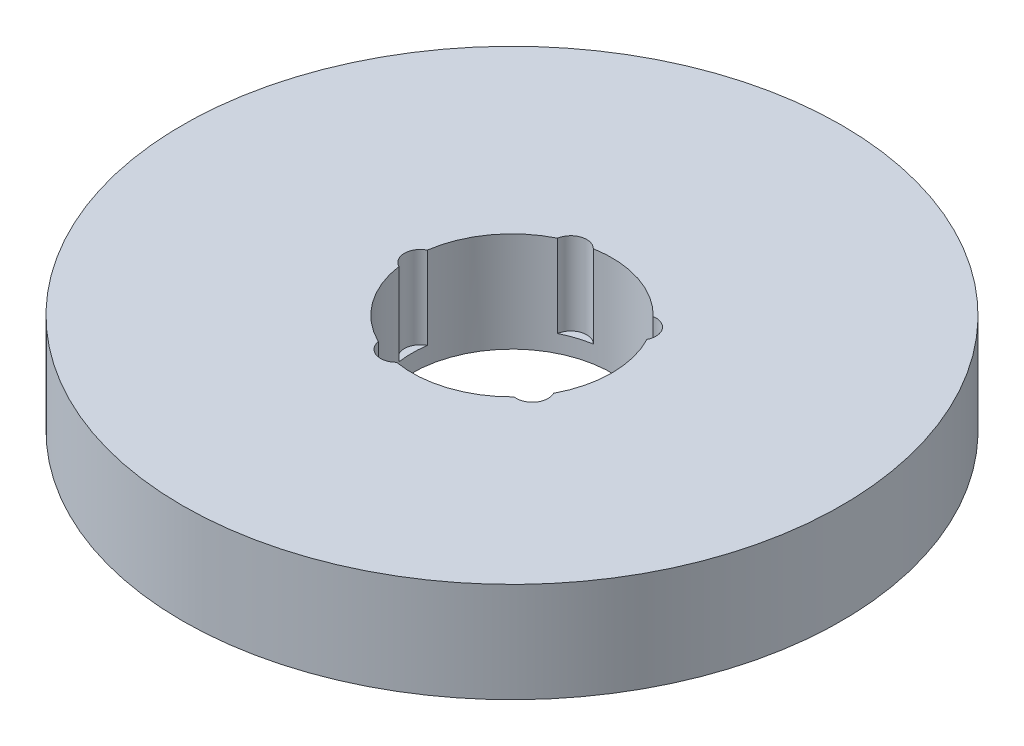
ISO-10303-21;
HEADER;
FILE_DESCRIPTION(('STEP AP214'),'2;1');
FILE_NAME('part.step','',(''),(''),'','','');
FILE_SCHEMA(('AUTOMOTIVE_DESIGN { 1 0 10303 214 1 1 1 1 }'));
ENDSEC;
DATA;
#1=APPLICATION_CONTEXT('core data for automotive mechanical design processes');
#2=APPLICATION_PROTOCOL_DEFINITION('international standard','automotive_design',2000,#1);
#3=PRODUCT_CONTEXT('',#1,'mechanical');
#4=PRODUCT('Part','Part','',(#3));
#5=PRODUCT_RELATED_PRODUCT_CATEGORY('part','',(#4));
#6=PRODUCT_DEFINITION_FORMATION('','',#4);
#7=PRODUCT_DEFINITION_CONTEXT('part definition',#1,'design');
#8=PRODUCT_DEFINITION('design','',#6,#7);
#9=PRODUCT_DEFINITION_SHAPE('','',#8);
#10=(LENGTH_UNIT() NAMED_UNIT(*) SI_UNIT(.MILLI.,.METRE.));
#11=(NAMED_UNIT(*) PLANE_ANGLE_UNIT() SI_UNIT($,.RADIAN.));
#12=(NAMED_UNIT(*) SI_UNIT($,.STERADIAN.) SOLID_ANGLE_UNIT());
#13=UNCERTAINTY_MEASURE_WITH_UNIT(LENGTH_MEASURE(1.E-05),#10,'distance_accuracy_value','');
#14=(GEOMETRIC_REPRESENTATION_CONTEXT(3) GLOBAL_UNCERTAINTY_ASSIGNED_CONTEXT((#13)) GLOBAL_UNIT_ASSIGNED_CONTEXT((#10,
#11,#12)) REPRESENTATION_CONTEXT('',''));
#15=CARTESIAN_POINT('',(0.,0.,0.));
#16=DIRECTION('',(0.,0.,1.));
#17=DIRECTION('',(1.,0.,0.));
#18=AXIS2_PLACEMENT_3D('',#15,#16,#17);
#19=CARTESIAN_POINT('',(0.,25.,0.));
#20=DIRECTION('',(0.,-1.,0.));
#21=DIRECTION('',(0.,0.,-1.));
#22=AXIS2_PLACEMENT_3D('',#19,#20,#21);
#23=CYLINDRICAL_SURFACE('',#22,82.5);
#24=CARTESIAN_POINT('',(0.,25.,0.));
#25=DIRECTION('',(0.,1.,0.));
#26=DIRECTION('',(0.,0.,1.));
#27=AXIS2_PLACEMENT_3D('',#24,#25,#26);
#28=CIRCLE('',#27,82.5);
#29=CARTESIAN_POINT('',(0.,25.,82.5));
#30=VERTEX_POINT('',#29);
#31=EDGE_CURVE('E159',#30,#30,#28,.T.);
#32=ORIENTED_EDGE('',*,*,#31,.F.);
#33=EDGE_LOOP('',(#32));
#34=FACE_BOUND('',#33,.T.);
#35=CARTESIAN_POINT('',(0.,0.,0.));
#36=DIRECTION('',(0.,1.,0.));
#37=DIRECTION('',(0.,0.,1.));
#38=AXIS2_PLACEMENT_3D('',#35,#36,#37);
#39=CIRCLE('',#38,82.5);
#40=CARTESIAN_POINT('',(0.,0.,82.5));
#41=VERTEX_POINT('',#40);
#42=EDGE_CURVE('E152',#41,#41,#39,.T.);
#43=ORIENTED_EDGE('',*,*,#42,.T.);
#44=EDGE_LOOP('',(#43));
#45=FACE_BOUND('',#44,.T.);
#46=ADVANCED_FACE('F39',(#34,#45),#23,.T.);
#47=CARTESIAN_POINT('',(0.,25.,0.));
#48=DIRECTION('',(0.,1.,0.));
#49=DIRECTION('',(0.,0.,1.));
#50=AXIS2_PLACEMENT_3D('',#47,#48,#49);
#51=PLANE('',#50);
#52=CARTESIAN_POINT('',(-7.0887619418406,25.,21.8169659273575));
#53=DIRECTION('',(0.,1.,0.));
#54=DIRECTION('',(0.951056516295155,0.,0.309016994374945));
#55=AXIS2_PLACEMENT_3D('',#52,#53,#54);
#56=CIRCLE('',#55,3.98516657410664);
#57=CARTESIAN_POINT('',(-11.0253166271495,25.,22.4375219948884));
#58=VERTEX_POINT('',#57);
#59=CARTESIAN_POINT('',(-4.26877600685464,25.,24.6328551208199));
#60=VERTEX_POINT('',#59);
#61=EDGE_CURVE('E192',#58,#60,#56,.T.);
#62=ORIENTED_EDGE('',*,*,#61,.F.);
#63=CARTESIAN_POINT('',(0.,25.,0.));
#64=DIRECTION('',(0.,1.,0.));
#65=DIRECTION('',(0.,0.,1.));
#66=AXIS2_PLACEMENT_3D('',#63,#64,#65);
#67=CIRCLE('',#66,25.);
#68=CARTESIAN_POINT('',(-24.7463617089083,25.,3.55212361438571));
#69=VERTEX_POINT('',#68);
#70=EDGE_CURVE('E147',#69,#58,#67,.T.);
#71=ORIENTED_EDGE('',*,*,#70,.F.);
#72=CARTESIAN_POINT('',(-22.9397155201098,25.,0.));
#73=DIRECTION('',(0.,1.,0.));
#74=DIRECTION('',(0.,0.,1.));
#75=AXIS2_PLACEMENT_3D('',#72,#73,#74);
#76=CIRCLE('',#75,3.98516657410664);
#77=CARTESIAN_POINT('',(-24.7463617089083,25.,-3.55212361438571));
#78=VERTEX_POINT('',#77);
#79=EDGE_CURVE('E154',#78,#69,#76,.T.);
#80=ORIENTED_EDGE('',*,*,#79,.F.);
#81=CARTESIAN_POINT('',(-11.0253166271498,25.,-22.4375219948883));
#82=VERTEX_POINT('',#81);
#83=EDGE_CURVE('E136',#82,#78,#67,.T.);
#84=ORIENTED_EDGE('',*,*,#83,.F.);
#85=CARTESIAN_POINT('',(-7.0887619418409,25.,-21.8169659273574));
#86=DIRECTION('',(0.,1.,0.));
#87=DIRECTION('',(-0.95105651629515,0.,0.309016994374958));
#88=AXIS2_PLACEMENT_3D('',#85,#86,#87);
#89=CIRCLE('',#88,3.98516657410664);
#90=CARTESIAN_POINT('',(-4.26877600685499,25.,-24.6328551208198));
#91=VERTEX_POINT('',#90);
#92=EDGE_CURVE('E117',#91,#82,#89,.T.);
#93=ORIENTED_EDGE('',*,*,#92,.F.);
#94=CARTESIAN_POINT('',(17.9323412966004,25.,-17.4192748305502));
#95=VERTEX_POINT('',#94);
#96=EDGE_CURVE('E133',#95,#91,#67,.T.);
#97=ORIENTED_EDGE('',*,*,#96,.F.);
#98=CARTESIAN_POINT('',(18.5586197018954,25.,-13.4836264745055));
#99=DIRECTION('',(0.,1.,0.));
#100=DIRECTION('',(-0.58778525229248,0.,-0.809016994374942));
#101=AXIS2_PLACEMENT_3D('',#98,#99,#100);
#102=CIRCLE('',#101,3.98516657410664);
#103=CARTESIAN_POINT('',(22.1081130463119,25.,-11.6718180902331));
#104=VERTEX_POINT('',#103);
#105=EDGE_CURVE('E333',#104,#95,#102,.T.);
#106=ORIENTED_EDGE('',*,*,#105,.F.);
#107=CARTESIAN_POINT('',(22.1081130463121,25.,11.6718180902327));
#108=VERTEX_POINT('',#107);
#109=EDGE_CURVE('E144',#108,#104,#67,.T.);
#110=ORIENTED_EDGE('',*,*,#109,.F.);
#111=CARTESIAN_POINT('',(18.5586197018956,25.,13.4836264745052));
#112=DIRECTION('',(0.,1.,0.));
#113=DIRECTION('',(0.587785252292469,0.,-0.809016994374951));
#114=AXIS2_PLACEMENT_3D('',#111,#112,#113);
#115=CIRCLE('',#114,3.98516657410664);
#116=CARTESIAN_POINT('',(17.9323412966006,25.,17.41927483055));
#117=VERTEX_POINT('',#116);
#118=EDGE_CURVE('E328',#117,#108,#115,.T.);
#119=ORIENTED_EDGE('',*,*,#118,.F.);
#120=EDGE_CURVE('E146',#60,#117,#67,.T.);
#121=ORIENTED_EDGE('',*,*,#120,.F.);
#122=EDGE_LOOP('',(#62,#71,#80,#84,#93,#97,#106,#110,#119,#121));
#123=FACE_BOUND('',#122,.T.);
#124=ORIENTED_EDGE('',*,*,#31,.T.);
#125=EDGE_LOOP('',(#124));
#126=FACE_BOUND('',#125,.T.);
#127=ADVANCED_FACE('F131',(#123,#126),#51,.T.);
#128=CARTESIAN_POINT('',(0.,0.,0.));
#129=DIRECTION('',(0.,1.,0.));
#130=DIRECTION('',(0.,0.,1.));
#131=AXIS2_PLACEMENT_3D('',#128,#129,#130);
#132=PLANE('',#131);
#133=CARTESIAN_POINT('',(0.,0.,0.));
#134=DIRECTION('',(0.,1.,0.));
#135=DIRECTION('',(0.,0.,1.));
#136=AXIS2_PLACEMENT_3D('',#133,#134,#135);
#137=CIRCLE('',#136,25.);
#138=CARTESIAN_POINT('',(0.,0.,25.));
#139=VERTEX_POINT('',#138);
#140=EDGE_CURVE('E149',#139,#139,#137,.T.);
#141=ORIENTED_EDGE('',*,*,#140,.T.);
#142=EDGE_LOOP('',(#141));
#143=FACE_BOUND('',#142,.T.);
#144=ORIENTED_EDGE('',*,*,#42,.F.);
#145=EDGE_LOOP('',(#144));
#146=FACE_BOUND('',#145,.T.);
#147=ADVANCED_FACE('F209',(#143,#146),#132,.F.);
#148=CARTESIAN_POINT('',(0.,25.,0.));
#149=DIRECTION('',(0.,-1.,0.));
#150=DIRECTION('',(0.,0.,-1.));
#151=AXIS2_PLACEMENT_3D('',#148,#149,#150);
#152=CYLINDRICAL_SURFACE('',#151,25.);
#153=DIRECTION('',(0.,1.,0.));
#154=VECTOR('',#153,1.);
#155=CARTESIAN_POINT('',(-11.0253166271495,14.6669876071001,22.4375219948884));
#156=LINE('',#155,#154);
#157=CARTESIAN_POINT('',(-11.0253166271495,4.3339752142003,22.4375219948884));
#158=VERTEX_POINT('',#157);
#159=EDGE_CURVE('E11',#158,#58,#156,.T.);
#160=ORIENTED_EDGE('',*,*,#159,.F.);
#161=CARTESIAN_POINT('',(0.,4.3339752142003,0.));
#162=DIRECTION('',(0.,1.,0.));
#163=DIRECTION('',(0.,0.,1.));
#164=AXIS2_PLACEMENT_3D('',#161,#162,#163);
#165=CIRCLE('',#164,25.);
#166=CARTESIAN_POINT('',(-4.26877600685464,4.3339752142003,24.6328551208199));
#167=VERTEX_POINT('',#166);
#168=EDGE_CURVE('E187',#158,#167,#165,.T.);
#169=ORIENTED_EDGE('',*,*,#168,.T.);
#170=DIRECTION('',(0.,1.,0.));
#171=VECTOR('',#170,1.);
#172=CARTESIAN_POINT('',(-4.26877600685464,14.6669876071001,24.6328551208199));
#173=LINE('',#172,#171);
#174=EDGE_CURVE('E46',#60,#167,#173,.F.);
#175=ORIENTED_EDGE('',*,*,#174,.F.);
#176=ORIENTED_EDGE('',*,*,#120,.T.);
#177=DIRECTION('',(0.,1.,0.));
#178=VECTOR('',#177,1.);
#179=CARTESIAN_POINT('',(17.9323412966006,14.6669876071001,17.41927483055));
#180=LINE('',#179,#178);
#181=CARTESIAN_POINT('',(17.9323412966006,4.3339752142003,17.41927483055));
#182=VERTEX_POINT('',#181);
#183=EDGE_CURVE('E186',#182,#117,#180,.T.);
#184=ORIENTED_EDGE('',*,*,#183,.F.);
#185=CARTESIAN_POINT('',(0.,4.3339752142003,0.));
#186=DIRECTION('',(0.,1.,0.));
#187=DIRECTION('',(0.,0.,1.));
#188=AXIS2_PLACEMENT_3D('',#185,#186,#187);
#189=CIRCLE('',#188,25.);
#190=CARTESIAN_POINT('',(22.1081130463121,4.3339752142003,11.6718180902327));
#191=VERTEX_POINT('',#190);
#192=EDGE_CURVE('E182',#182,#191,#189,.T.);
#193=ORIENTED_EDGE('',*,*,#192,.T.);
#194=DIRECTION('',(0.,1.,0.));
#195=VECTOR('',#194,1.);
#196=CARTESIAN_POINT('',(22.1081130463121,14.6669876071001,11.6718180902327));
#197=LINE('',#196,#195);
#198=EDGE_CURVE('E184',#108,#191,#197,.F.);
#199=ORIENTED_EDGE('',*,*,#198,.F.);
#200=ORIENTED_EDGE('',*,*,#109,.T.);
#201=DIRECTION('',(0.,1.,0.));
#202=VECTOR('',#201,1.);
#203=CARTESIAN_POINT('',(22.1081130463119,14.6669876071001,-11.6718180902331));
#204=LINE('',#203,#202);
#205=CARTESIAN_POINT('',(22.1081130463119,4.3339752142003,-11.6718180902331));
#206=VERTEX_POINT('',#205);
#207=EDGE_CURVE('E178',#206,#104,#204,.T.);
#208=ORIENTED_EDGE('',*,*,#207,.F.);
#209=CARTESIAN_POINT('',(0.,4.3339752142003,0.));
#210=DIRECTION('',(0.,1.,0.));
#211=DIRECTION('',(0.,0.,1.));
#212=AXIS2_PLACEMENT_3D('',#209,#210,#211);
#213=CIRCLE('',#212,25.);
#214=CARTESIAN_POINT('',(17.9323412966004,4.3339752142003,-17.4192748305502));
#215=VERTEX_POINT('',#214);
#216=EDGE_CURVE('E123',#206,#215,#213,.T.);
#217=ORIENTED_EDGE('',*,*,#216,.T.);
#218=DIRECTION('',(0.,1.,0.));
#219=VECTOR('',#218,1.);
#220=CARTESIAN_POINT('',(17.9323412966004,14.6669876071001,-17.4192748305502));
#221=LINE('',#220,#219);
#222=EDGE_CURVE('E145',#95,#215,#221,.F.);
#223=ORIENTED_EDGE('',*,*,#222,.F.);
#224=ORIENTED_EDGE('',*,*,#96,.T.);
#225=DIRECTION('',(0.,1.,0.));
#226=VECTOR('',#225,1.);
#227=CARTESIAN_POINT('',(-4.26877600685499,14.6669876071001,-24.6328551208198));
#228=LINE('',#227,#226);
#229=CARTESIAN_POINT('',(-4.26877600685499,4.3339752142003,-24.6328551208198));
#230=VERTEX_POINT('',#229);
#231=EDGE_CURVE('E111',#230,#91,#228,.T.);
#232=ORIENTED_EDGE('',*,*,#231,.F.);
#233=CARTESIAN_POINT('',(0.,4.3339752142003,0.));
#234=DIRECTION('',(0.,1.,0.));
#235=DIRECTION('',(0.,0.,1.));
#236=AXIS2_PLACEMENT_3D('',#233,#234,#235);
#237=CIRCLE('',#236,25.);
#238=CARTESIAN_POINT('',(-11.0253166271498,4.3339752142003,-22.4375219948883));
#239=VERTEX_POINT('',#238);
#240=EDGE_CURVE('E173',#230,#239,#237,.T.);
#241=ORIENTED_EDGE('',*,*,#240,.T.);
#242=DIRECTION('',(0.,1.,0.));
#243=VECTOR('',#242,1.);
#244=CARTESIAN_POINT('',(-11.0253166271498,14.6669876071001,-22.4375219948883));
#245=LINE('',#244,#243);
#246=EDGE_CURVE('E124',#82,#239,#245,.F.);
#247=ORIENTED_EDGE('',*,*,#246,.F.);
#248=ORIENTED_EDGE('',*,*,#83,.T.);
#249=DIRECTION('',(0.,1.,0.));
#250=VECTOR('',#249,1.);
#251=CARTESIAN_POINT('',(-24.7463617089083,14.6669876071001,-3.55212361438571));
#252=LINE('',#251,#250);
#253=CARTESIAN_POINT('',(-24.7463617089083,4.3339752142003,-3.55212361438571));
#254=VERTEX_POINT('',#253);
#255=EDGE_CURVE('E171',#254,#78,#252,.T.);
#256=ORIENTED_EDGE('',*,*,#255,.F.);
#257=CARTESIAN_POINT('',(0.,4.3339752142003,0.));
#258=DIRECTION('',(0.,1.,0.));
#259=DIRECTION('',(0.,0.,1.));
#260=AXIS2_PLACEMENT_3D('',#257,#258,#259);
#261=CIRCLE('',#260,25.);
#262=CARTESIAN_POINT('',(-24.7463617089083,4.3339752142003,3.55212361438571));
#263=VERTEX_POINT('',#262);
#264=EDGE_CURVE('E162',#254,#263,#261,.T.);
#265=ORIENTED_EDGE('',*,*,#264,.T.);
#266=DIRECTION('',(0.,1.,0.));
#267=VECTOR('',#266,1.);
#268=CARTESIAN_POINT('',(-24.7463617089083,14.6669876071001,3.55212361438571));
#269=LINE('',#268,#267);
#270=EDGE_CURVE('E169',#69,#263,#269,.F.);
#271=ORIENTED_EDGE('',*,*,#270,.F.);
#272=ORIENTED_EDGE('',*,*,#70,.T.);
#273=EDGE_LOOP('',(#160,#169,#175,#176,#184,#193,#199,#200,#208,#217,#223,#224,#232,#241,#247,
#248,#256,#265,#271,#272));
#274=FACE_BOUND('',#273,.T.);
#275=ORIENTED_EDGE('',*,*,#140,.F.);
#276=EDGE_LOOP('',(#275));
#277=FACE_BOUND('',#276,.T.);
#278=ADVANCED_FACE('F139',(#274,#277),#152,.F.);
#279=CARTESIAN_POINT('',(-22.9397155201098,4.3339752142003,0.));
#280=DIRECTION('',(0.,1.,0.));
#281=DIRECTION('',(0.,0.,1.));
#282=AXIS2_PLACEMENT_3D('',#279,#280,#281);
#283=CYLINDRICAL_SURFACE('',#282,3.98516657410664);
#284=ORIENTED_EDGE('',*,*,#255,.T.);
#285=ORIENTED_EDGE('',*,*,#79,.T.);
#286=ORIENTED_EDGE('',*,*,#270,.T.);
#287=CARTESIAN_POINT('',(-22.9397155201098,4.3339752142003,0.));
#288=DIRECTION('',(0.,1.,0.));
#289=DIRECTION('',(0.,0.,1.));
#290=AXIS2_PLACEMENT_3D('',#287,#288,#289);
#291=CIRCLE('',#290,3.98516657410664);
#292=EDGE_CURVE('E157',#254,#263,#291,.T.);
#293=ORIENTED_EDGE('',*,*,#292,.F.);
#294=EDGE_LOOP('',(#284,#285,#286,#293));
#295=FACE_BOUND('',#294,.T.);
#296=ADVANCED_FACE('F222',(#295),#283,.F.);
#297=CARTESIAN_POINT('',(-22.9397155201098,4.3339752142003,0.));
#298=DIRECTION('',(0.,1.,0.));
#299=DIRECTION('',(0.,0.,1.));
#300=AXIS2_PLACEMENT_3D('',#297,#298,#299);
#301=PLANE('',#300);
#302=ORIENTED_EDGE('',*,*,#292,.T.);
#303=ORIENTED_EDGE('',*,*,#264,.F.);
#304=EDGE_LOOP('',(#302,#303));
#305=FACE_BOUND('',#304,.T.);
#306=ADVANCED_FACE('F223',(#305),#301,.T.);
#307=CARTESIAN_POINT('',(-7.0887619418409,4.3339752142003,-21.8169659273574));
#308=DIRECTION('',(0.,1.,0.));
#309=DIRECTION('',(0.,0.,1.));
#310=AXIS2_PLACEMENT_3D('',#307,#308,#309);
#311=CYLINDRICAL_SURFACE('',#310,3.98516657410664);
#312=ORIENTED_EDGE('',*,*,#231,.T.);
#313=ORIENTED_EDGE('',*,*,#92,.T.);
#314=ORIENTED_EDGE('',*,*,#246,.T.);
#315=CARTESIAN_POINT('',(-7.0887619418409,4.3339752142003,-21.8169659273574));
#316=DIRECTION('',(0.,1.,0.));
#317=DIRECTION('',(-0.95105651629515,0.,0.309016994374958));
#318=AXIS2_PLACEMENT_3D('',#315,#316,#317);
#319=CIRCLE('',#318,3.98516657410664);
#320=EDGE_CURVE('E119',#230,#239,#319,.T.);
#321=ORIENTED_EDGE('',*,*,#320,.F.);
#322=EDGE_LOOP('',(#312,#313,#314,#321));
#323=FACE_BOUND('',#322,.T.);
#324=ADVANCED_FACE('F116',(#323),#311,.F.);
#325=CARTESIAN_POINT('',(-7.0887619418409,4.3339752142003,-21.8169659273574));
#326=DIRECTION('',(0.,1.,0.));
#327=DIRECTION('',(-0.95105651629515,0.,0.309016994374958));
#328=AXIS2_PLACEMENT_3D('',#325,#326,#327);
#329=PLANE('',#328);
#330=ORIENTED_EDGE('',*,*,#320,.T.);
#331=ORIENTED_EDGE('',*,*,#240,.F.);
#332=EDGE_LOOP('',(#330,#331));
#333=FACE_BOUND('',#332,.T.);
#334=ADVANCED_FACE('F235',(#333),#329,.T.);
#335=CARTESIAN_POINT('',(18.5586197018954,4.3339752142003,-13.4836264745055));
#336=DIRECTION('',(0.,1.,0.));
#337=DIRECTION('',(0.,0.,1.));
#338=AXIS2_PLACEMENT_3D('',#335,#336,#337);
#339=CYLINDRICAL_SURFACE('',#338,3.98516657410664);
#340=ORIENTED_EDGE('',*,*,#207,.T.);
#341=ORIENTED_EDGE('',*,*,#105,.T.);
#342=ORIENTED_EDGE('',*,*,#222,.T.);
#343=CARTESIAN_POINT('',(18.5586197018954,4.3339752142003,-13.4836264745055));
#344=DIRECTION('',(0.,1.,0.));
#345=DIRECTION('',(-0.58778525229248,0.,-0.809016994374942));
#346=AXIS2_PLACEMENT_3D('',#343,#344,#345);
#347=CIRCLE('',#346,3.98516657410664);
#348=EDGE_CURVE('E335',#206,#215,#347,.T.);
#349=ORIENTED_EDGE('',*,*,#348,.F.);
#350=EDGE_LOOP('',(#340,#341,#342,#349));
#351=FACE_BOUND('',#350,.T.);
#352=ADVANCED_FACE('F234',(#351),#339,.F.);
#353=CARTESIAN_POINT('',(18.5586197018954,4.3339752142003,-13.4836264745055));
#354=DIRECTION('',(0.,1.,0.));
#355=DIRECTION('',(-0.58778525229248,0.,-0.809016994374942));
#356=AXIS2_PLACEMENT_3D('',#353,#354,#355);
#357=PLANE('',#356);
#358=ORIENTED_EDGE('',*,*,#348,.T.);
#359=ORIENTED_EDGE('',*,*,#216,.F.);
#360=EDGE_LOOP('',(#358,#359));
#361=FACE_BOUND('',#360,.T.);
#362=ADVANCED_FACE('F239',(#361),#357,.T.);
#363=CARTESIAN_POINT('',(18.5586197018956,4.3339752142003,13.4836264745052));
#364=DIRECTION('',(0.,1.,0.));
#365=DIRECTION('',(0.,0.,1.));
#366=AXIS2_PLACEMENT_3D('',#363,#364,#365);
#367=CYLINDRICAL_SURFACE('',#366,3.98516657410664);
#368=ORIENTED_EDGE('',*,*,#183,.T.);
#369=ORIENTED_EDGE('',*,*,#118,.T.);
#370=ORIENTED_EDGE('',*,*,#198,.T.);
#371=CARTESIAN_POINT('',(18.5586197018956,4.3339752142003,13.4836264745052));
#372=DIRECTION('',(0.,1.,0.));
#373=DIRECTION('',(0.587785252292469,0.,-0.809016994374951));
#374=AXIS2_PLACEMENT_3D('',#371,#372,#373);
#375=CIRCLE('',#374,3.98516657410664);
#376=EDGE_CURVE('E56',#182,#191,#375,.T.);
#377=ORIENTED_EDGE('',*,*,#376,.F.);
#378=EDGE_LOOP('',(#368,#369,#370,#377));
#379=FACE_BOUND('',#378,.T.);
#380=ADVANCED_FACE('F242',(#379),#367,.F.);
#381=CARTESIAN_POINT('',(18.5586197018956,4.3339752142003,13.4836264745052));
#382=DIRECTION('',(0.,1.,0.));
#383=DIRECTION('',(0.587785252292469,0.,-0.809016994374951));
#384=AXIS2_PLACEMENT_3D('',#381,#382,#383);
#385=PLANE('',#384);
#386=ORIENTED_EDGE('',*,*,#376,.T.);
#387=ORIENTED_EDGE('',*,*,#192,.F.);
#388=EDGE_LOOP('',(#386,#387));
#389=FACE_BOUND('',#388,.T.);
#390=ADVANCED_FACE('F205',(#389),#385,.T.);
#391=CARTESIAN_POINT('',(-7.0887619418406,4.3339752142003,21.8169659273575));
#392=DIRECTION('',(0.,1.,0.));
#393=DIRECTION('',(0.,0.,1.));
#394=AXIS2_PLACEMENT_3D('',#391,#392,#393);
#395=CYLINDRICAL_SURFACE('',#394,3.98516657410664);
#396=ORIENTED_EDGE('',*,*,#159,.T.);
#397=ORIENTED_EDGE('',*,*,#61,.T.);
#398=ORIENTED_EDGE('',*,*,#174,.T.);
#399=CARTESIAN_POINT('',(-7.0887619418406,4.3339752142003,21.8169659273575));
#400=DIRECTION('',(0.,1.,0.));
#401=DIRECTION('',(0.951056516295155,0.,0.309016994374945));
#402=AXIS2_PLACEMENT_3D('',#399,#400,#401);
#403=CIRCLE('',#402,3.98516657410664);
#404=EDGE_CURVE('E55',#158,#167,#403,.T.);
#405=ORIENTED_EDGE('',*,*,#404,.F.);
#406=EDGE_LOOP('',(#396,#397,#398,#405));
#407=FACE_BOUND('',#406,.T.);
#408=ADVANCED_FACE('F195',(#407),#395,.F.);
#409=CARTESIAN_POINT('',(-7.0887619418406,4.3339752142003,21.8169659273575));
#410=DIRECTION('',(0.,1.,0.));
#411=DIRECTION('',(0.951056516295155,0.,0.309016994374945));
#412=AXIS2_PLACEMENT_3D('',#409,#410,#411);
#413=PLANE('',#412);
#414=ORIENTED_EDGE('',*,*,#404,.T.);
#415=ORIENTED_EDGE('',*,*,#168,.F.);
#416=EDGE_LOOP('',(#414,#415));
#417=FACE_BOUND('',#416,.T.);
#418=ADVANCED_FACE('F198',(#417),#413,.T.);
#419=CLOSED_SHELL('',(#46,#127,#147,#278,#296,#306,#324,#334,#352,#362,#380,#390,#408,#418));
#420=MANIFOLD_SOLID_BREP('B2',#419);
#421=ADVANCED_BREP_SHAPE_REPRESENTATION('',(#18,#420),#14);
#422=SHAPE_DEFINITION_REPRESENTATION(#9,#421);
ENDSEC;
END-ISO-10303-21;
